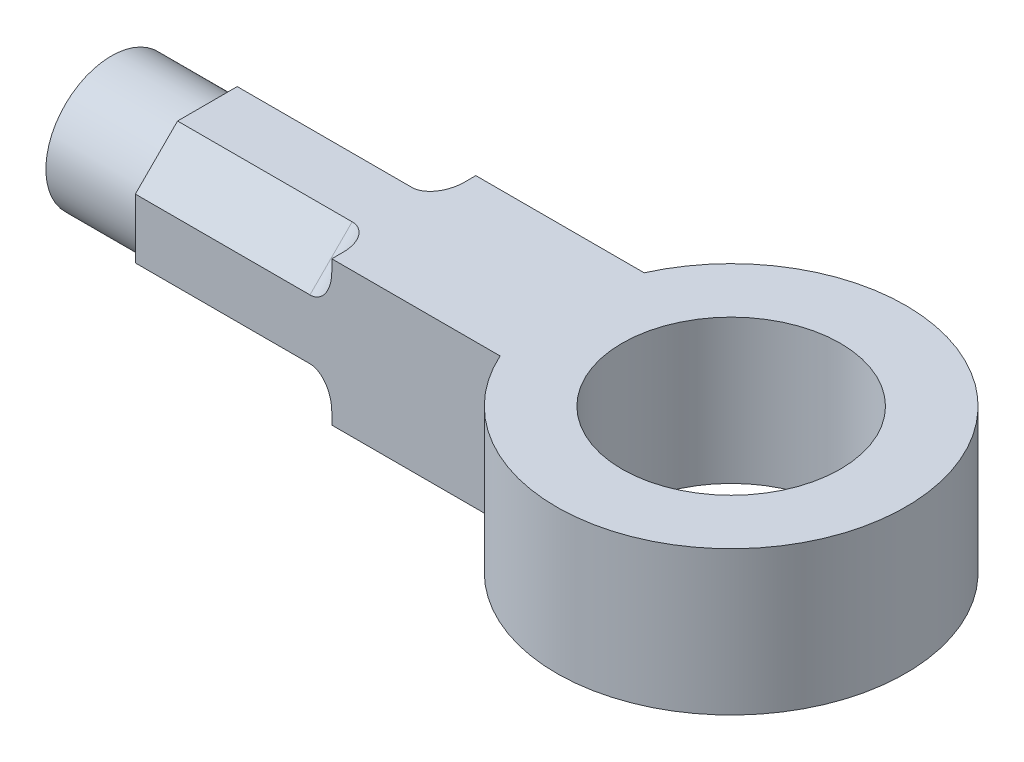
ISO-10303-21;
HEADER;
FILE_DESCRIPTION(('STEP AP214'),'2;1');
FILE_NAME('part.step','',(''),(''),'','','');
FILE_SCHEMA(('AUTOMOTIVE_DESIGN { 1 0 10303 214 1 1 1 1 }'));
ENDSEC;
DATA;
#1=APPLICATION_CONTEXT('core data for automotive mechanical design processes');
#2=APPLICATION_PROTOCOL_DEFINITION('international standard','automotive_design',2000,#1);
#3=PRODUCT_CONTEXT('',#1,'mechanical');
#4=PRODUCT('Part','Part','',(#3));
#5=PRODUCT_RELATED_PRODUCT_CATEGORY('part','',(#4));
#6=PRODUCT_DEFINITION_FORMATION('','',#4);
#7=PRODUCT_DEFINITION_CONTEXT('part definition',#1,'design');
#8=PRODUCT_DEFINITION('design','',#6,#7);
#9=PRODUCT_DEFINITION_SHAPE('','',#8);
#10=(LENGTH_UNIT() NAMED_UNIT(*) SI_UNIT(.MILLI.,.METRE.));
#11=(NAMED_UNIT(*) PLANE_ANGLE_UNIT() SI_UNIT($,.RADIAN.));
#12=(NAMED_UNIT(*) SI_UNIT($,.STERADIAN.) SOLID_ANGLE_UNIT());
#13=UNCERTAINTY_MEASURE_WITH_UNIT(LENGTH_MEASURE(1.E-05),#10,'distance_accuracy_value','');
#14=(GEOMETRIC_REPRESENTATION_CONTEXT(3) GLOBAL_UNCERTAINTY_ASSIGNED_CONTEXT((#13)) GLOBAL_UNIT_ASSIGNED_CONTEXT((#10,
#11,#12)) REPRESENTATION_CONTEXT('',''));
#15=CARTESIAN_POINT('',(0.,0.,0.));
#16=DIRECTION('',(0.,0.,1.));
#17=DIRECTION('',(1.,0.,0.));
#18=AXIS2_PLACEMENT_3D('',#15,#16,#17);
#19=CARTESIAN_POINT('',(-43.5576432117348,0.,0.));
#20=DIRECTION('',(-1.,0.,0.));
#21=DIRECTION('',(0.,0.,1.));
#22=AXIS2_PLACEMENT_3D('',#19,#20,#21);
#23=PLANE('',#22);
#24=DIRECTION('',(0.,0.,1.));
#25=VECTOR('',#24,1.);
#26=CARTESIAN_POINT('',(-43.5576432117348,1.65,-1.65));
#27=LINE('',#26,#25);
#28=CARTESIAN_POINT('',(-43.5576432117348,1.65,1.39055915910215));
#29=VERTEX_POINT('',#28);
#30=CARTESIAN_POINT('',(-43.5576432117348,1.65,1.65));
#31=VERTEX_POINT('',#30);
#32=EDGE_CURVE('E251',#29,#31,#27,.T.);
#33=ORIENTED_EDGE('',*,*,#32,.F.);
#34=DIRECTION('',(0.,-0.707106781186548,0.707106781186547));
#35=VECTOR('',#34,1.);
#36=CARTESIAN_POINT('',(-43.5576432117348,1.52027957955108,1.52027957955108));
#37=LINE('',#36,#35);
#38=CARTESIAN_POINT('',(-43.5576432117348,1.39055915910216,1.65));
#39=VERTEX_POINT('',#38);
#40=EDGE_CURVE('E201',#29,#39,#37,.T.);
#41=ORIENTED_EDGE('',*,*,#40,.T.);
#42=DIRECTION('',(0.,-1.,0.));
#43=VECTOR('',#42,1.);
#44=CARTESIAN_POINT('',(-43.5576432117348,1.65,1.65));
#45=LINE('',#44,#43);
#46=EDGE_CURVE('E191',#31,#39,#45,.T.);
#47=ORIENTED_EDGE('',*,*,#46,.F.);
#48=EDGE_LOOP('',(#33,#41,#47));
#49=FACE_BOUND('',#48,.T.);
#50=ADVANCED_FACE('F38',(#49),#23,.T.);
#51=CARTESIAN_POINT('',(-43.5576432117348,-1.39055915910215,1.65));
#52=VERTEX_POINT('',#51);
#53=CARTESIAN_POINT('',(-43.5576432117348,-1.65,1.65));
#54=VERTEX_POINT('',#53);
#55=EDGE_CURVE('E156',#52,#54,#45,.T.);
#56=ORIENTED_EDGE('',*,*,#55,.F.);
#57=DIRECTION('',(0.,-0.707106781186548,-0.707106781186548));
#58=VECTOR('',#57,1.);
#59=CARTESIAN_POINT('',(-43.5576432117348,-1.52027957955108,1.52027957955108));
#60=LINE('',#59,#58);
#61=CARTESIAN_POINT('',(-43.5576432117348,-1.65,1.39055915910215));
#62=VERTEX_POINT('',#61);
#63=EDGE_CURVE('E186',#52,#62,#60,.T.);
#64=ORIENTED_EDGE('',*,*,#63,.T.);
#65=DIRECTION('',(0.,0.,-1.));
#66=VECTOR('',#65,1.);
#67=CARTESIAN_POINT('',(-43.5576432117348,-1.65,-1.65));
#68=LINE('',#67,#66);
#69=EDGE_CURVE('E237',#54,#62,#68,.T.);
#70=ORIENTED_EDGE('',*,*,#69,.F.);
#71=EDGE_LOOP('',(#56,#64,#70));
#72=FACE_BOUND('',#71,.T.);
#73=ADVANCED_FACE('F355',(#72),#23,.T.);
#74=CARTESIAN_POINT('',(-43.5576432117348,-1.65,-1.39055915910215));
#75=VERTEX_POINT('',#74);
#76=CARTESIAN_POINT('',(-43.5576432117348,-1.65,-1.65));
#77=VERTEX_POINT('',#76);
#78=EDGE_CURVE('E239',#75,#77,#68,.T.);
#79=ORIENTED_EDGE('',*,*,#78,.F.);
#80=DIRECTION('',(0.,0.707106781186547,-0.707106781186548));
#81=VECTOR('',#80,1.);
#82=CARTESIAN_POINT('',(-43.5576432117348,-1.52027957955108,-1.52027957955108));
#83=LINE('',#82,#81);
#84=CARTESIAN_POINT('',(-43.5576432117348,-1.39055915910215,-1.65));
#85=VERTEX_POINT('',#84);
#86=EDGE_CURVE('E194',#75,#85,#83,.T.);
#87=ORIENTED_EDGE('',*,*,#86,.T.);
#88=DIRECTION('',(0.,1.,0.));
#89=VECTOR('',#88,1.);
#90=CARTESIAN_POINT('',(-43.5576432117348,1.65,-1.65));
#91=LINE('',#90,#89);
#92=EDGE_CURVE('E242',#77,#85,#91,.T.);
#93=ORIENTED_EDGE('',*,*,#92,.F.);
#94=EDGE_LOOP('',(#79,#87,#93));
#95=FACE_BOUND('',#94,.T.);
#96=ADVANCED_FACE('F362',(#95),#23,.T.);
#97=CARTESIAN_POINT('',(-43.5576432117348,1.39055915910216,-1.65));
#98=VERTEX_POINT('',#97);
#99=CARTESIAN_POINT('',(-43.5576432117348,1.65,-1.65));
#100=VERTEX_POINT('',#99);
#101=EDGE_CURVE('E245',#98,#100,#91,.T.);
#102=ORIENTED_EDGE('',*,*,#101,.F.);
#103=DIRECTION('',(0.,0.707106781186548,0.707106781186548));
#104=VECTOR('',#103,1.);
#105=CARTESIAN_POINT('',(-43.5576432117348,1.52027957955108,-1.52027957955108));
#106=LINE('',#105,#104);
#107=CARTESIAN_POINT('',(-43.5576432117348,1.65,-1.39055915910215));
#108=VERTEX_POINT('',#107);
#109=EDGE_CURVE('E208',#98,#108,#106,.T.);
#110=ORIENTED_EDGE('',*,*,#109,.T.);
#111=EDGE_CURVE('E249',#100,#108,#27,.T.);
#112=ORIENTED_EDGE('',*,*,#111,.F.);
#113=EDGE_LOOP('',(#102,#110,#112));
#114=FACE_BOUND('',#113,.T.);
#115=ADVANCED_FACE('F358',(#114),#23,.T.);
#116=CARTESIAN_POINT('',(-36.0576432117348,1.8,0.));
#117=DIRECTION('',(0.,-1.,0.));
#118=DIRECTION('',(0.,0.,-1.));
#119=AXIS2_PLACEMENT_3D('',#116,#117,#118);
#120=CYLINDRICAL_SURFACE('',#119,4.);
#121=DIRECTION('',(0.,-1.,0.));
#122=VECTOR('',#121,1.);
#123=CARTESIAN_POINT('',(-39.7014736139352,1.8,1.65));
#124=LINE('',#123,#122);
#125=CARTESIAN_POINT('',(-39.7014736139352,1.65,1.65));
#126=VERTEX_POINT('',#125);
#127=CARTESIAN_POINT('',(-39.7014736139383,-1.65,1.65));
#128=VERTEX_POINT('',#127);
#129=EDGE_CURVE('E154',#126,#128,#124,.T.);
#130=ORIENTED_EDGE('',*,*,#129,.T.);
#131=CARTESIAN_POINT('',(-36.0576432117348,-1.65,0.));
#132=DIRECTION('',(0.,1.,0.));
#133=DIRECTION('',(0.,0.,1.));
#134=AXIS2_PLACEMENT_3D('',#131,#132,#133);
#135=CIRCLE('',#134,4.);
#136=CARTESIAN_POINT('',(-39.7014736139352,-1.65,-1.65));
#137=VERTEX_POINT('',#136);
#138=EDGE_CURVE('E164',#128,#137,#135,.T.);
#139=ORIENTED_EDGE('',*,*,#138,.T.);
#140=DIRECTION('',(0.,-1.,0.));
#141=VECTOR('',#140,1.);
#142=CARTESIAN_POINT('',(-39.7014736139352,1.8,-1.65));
#143=LINE('',#142,#141);
#144=CARTESIAN_POINT('',(-39.7014736139383,1.65,-1.65));
#145=VERTEX_POINT('',#144);
#146=EDGE_CURVE('E179',#137,#145,#143,.F.);
#147=ORIENTED_EDGE('',*,*,#146,.T.);
#148=CARTESIAN_POINT('',(-36.0576432117348,1.65,0.));
#149=DIRECTION('',(0.,-1.,0.));
#150=DIRECTION('',(0.,0.,-1.));
#151=AXIS2_PLACEMENT_3D('',#148,#149,#150);
#152=CIRCLE('',#151,4.);
#153=EDGE_CURVE('E177',#145,#126,#152,.T.);
#154=ORIENTED_EDGE('',*,*,#153,.T.);
#155=EDGE_LOOP('',(#130,#139,#147,#154));
#156=FACE_BOUND('',#155,.T.);
#157=ADVANCED_FACE('F175',(#156),#120,.T.);
#158=CARTESIAN_POINT('',(-36.0576432117348,1.8,0.));
#159=DIRECTION('',(0.,-1.,0.));
#160=DIRECTION('',(0.,0.,-1.));
#161=AXIS2_PLACEMENT_3D('',#158,#159,#160);
#162=CYLINDRICAL_SURFACE('',#161,2.5);
#163=CARTESIAN_POINT('',(-36.0576432117348,-1.65,0.));
#164=DIRECTION('',(0.,1.,0.));
#165=DIRECTION('',(0.,0.,1.));
#166=AXIS2_PLACEMENT_3D('',#163,#164,#165);
#167=CIRCLE('',#166,2.5);
#168=CARTESIAN_POINT('',(-36.0576432117348,-1.65,2.5));
#169=VERTEX_POINT('',#168);
#170=EDGE_CURVE('E172',#169,#169,#167,.T.);
#171=ORIENTED_EDGE('',*,*,#170,.F.);
#172=EDGE_LOOP('',(#171));
#173=FACE_BOUND('',#172,.T.);
#174=CARTESIAN_POINT('',(-36.0576432117348,1.65,0.));
#175=DIRECTION('',(0.,-1.,0.));
#176=DIRECTION('',(0.,0.,-1.));
#177=AXIS2_PLACEMENT_3D('',#174,#175,#176);
#178=CIRCLE('',#177,2.5);
#179=CARTESIAN_POINT('',(-36.0576432117348,1.65,-2.5));
#180=VERTEX_POINT('',#179);
#181=EDGE_CURVE('E322',#180,#180,#178,.T.);
#182=ORIENTED_EDGE('',*,*,#181,.F.);
#183=EDGE_LOOP('',(#182));
#184=FACE_BOUND('',#183,.T.);
#185=ADVANCED_FACE('F335',(#173,#184),#162,.F.);
#186=CARTESIAN_POINT('',(49963.9423567883,1.65,1.65));
#187=DIRECTION('',(0.,0.,-1.));
#188=DIRECTION('',(0.,1.,0.));
#189=AXIS2_PLACEMENT_3D('',#186,#187,#188);
#190=PLANE('',#189);
#191=DIRECTION('',(-1.,0.,0.));
#192=VECTOR('',#191,1.);
#193=CARTESIAN_POINT('',(49963.9423567883,-1.65,1.65));
#194=LINE('',#193,#192);
#195=EDGE_CURVE('E150',#128,#54,#194,.T.);
#196=ORIENTED_EDGE('',*,*,#195,.F.);
#197=ORIENTED_EDGE('',*,*,#129,.F.);
#198=DIRECTION('',(-1.,0.,0.));
#199=VECTOR('',#198,1.);
#200=CARTESIAN_POINT('',(49963.9423567883,1.65,1.65));
#201=LINE('',#200,#199);
#202=EDGE_CURVE('E255',#126,#31,#201,.T.);
#203=ORIENTED_EDGE('',*,*,#202,.T.);
#204=ORIENTED_EDGE('',*,*,#46,.T.);
#205=CARTESIAN_POINT('',(-44.0576432117348,1.39055915910216,1.65));
#206=DIRECTION('',(0.,0.,-1.));
#207=DIRECTION('',(0.,-1.,0.));
#208=AXIS2_PLACEMENT_3D('',#205,#206,#207);
#209=ELLIPSE('',#208,0.707106781186547,0.5);
#210=CARTESIAN_POINT('',(-44.0576432117348,0.683452377915609,1.65));
#211=VERTEX_POINT('',#210);
#212=EDGE_CURVE('E226',#39,#211,#209,.T.);
#213=ORIENTED_EDGE('',*,*,#212,.T.);
#214=DIRECTION('',(-1.,0.,0.));
#215=VECTOR('',#214,1.);
#216=CARTESIAN_POINT('',(-43.5576432117348,0.683452377915609,1.65));
#217=LINE('',#216,#215);
#218=CARTESIAN_POINT('',(-48.0576432117348,0.683452377915609,1.65));
#219=VERTEX_POINT('',#218);
#220=EDGE_CURVE('E182',#211,#219,#217,.T.);
#221=ORIENTED_EDGE('',*,*,#220,.T.);
#222=DIRECTION('',(0.,-1.,0.));
#223=VECTOR('',#222,1.);
#224=CARTESIAN_POINT('',(-48.0576432117348,0.683452377915609,1.65));
#225=LINE('',#224,#223);
#226=CARTESIAN_POINT('',(-48.0576432117348,-0.683452377915605,1.65));
#227=VERTEX_POINT('',#226);
#228=EDGE_CURVE('E309',#219,#227,#225,.T.);
#229=ORIENTED_EDGE('',*,*,#228,.T.);
#230=DIRECTION('',(-1.,0.,0.));
#231=VECTOR('',#230,1.);
#232=CARTESIAN_POINT('',(-43.5576432117348,-0.683452377915605,1.65));
#233=LINE('',#232,#231);
#234=CARTESIAN_POINT('',(-44.0576432117348,-0.683452377915605,1.65));
#235=VERTEX_POINT('',#234);
#236=EDGE_CURVE('E265',#235,#227,#233,.T.);
#237=ORIENTED_EDGE('',*,*,#236,.F.);
#238=CARTESIAN_POINT('',(-44.0576432117348,-1.39055915910215,1.65));
#239=DIRECTION('',(0.,0.,-1.));
#240=DIRECTION('',(0.,-1.,0.));
#241=AXIS2_PLACEMENT_3D('',#238,#239,#240);
#242=ELLIPSE('',#241,0.707106781186548,0.5);
#243=EDGE_CURVE('E217',#235,#52,#242,.T.);
#244=ORIENTED_EDGE('',*,*,#243,.T.);
#245=ORIENTED_EDGE('',*,*,#55,.T.);
#246=EDGE_LOOP('',(#196,#197,#203,#204,#213,#221,#229,#237,#244,#245));
#247=FACE_BOUND('',#246,.T.);
#248=ADVANCED_FACE('F152',(#247),#190,.F.);
#249=CARTESIAN_POINT('',(49963.9423567883,-1.65,-1.65));
#250=DIRECTION('',(0.,1.,0.));
#251=DIRECTION('',(0.,0.,1.));
#252=AXIS2_PLACEMENT_3D('',#249,#250,#251);
#253=PLANE('',#252);
#254=DIRECTION('',(0.,0.,-1.));
#255=VECTOR('',#254,1.);
#256=CARTESIAN_POINT('',(-48.0576432117348,-1.65,0.683452377915607));
#257=LINE('',#256,#255);
#258=CARTESIAN_POINT('',(-48.0576432117348,-1.65,0.683452377915607));
#259=VERTEX_POINT('',#258);
#260=CARTESIAN_POINT('',(-48.0576432117348,-1.65,-0.683452377915607));
#261=VERTEX_POINT('',#260);
#262=EDGE_CURVE('E302',#259,#261,#257,.T.);
#263=ORIENTED_EDGE('',*,*,#262,.T.);
#264=DIRECTION('',(-1.,0.,0.));
#265=VECTOR('',#264,1.);
#266=CARTESIAN_POINT('',(-43.5576432117348,-1.65,-0.683452377915607));
#267=LINE('',#266,#265);
#268=CARTESIAN_POINT('',(-44.0576432117348,-1.65,-0.683452377915607));
#269=VERTEX_POINT('',#268);
#270=EDGE_CURVE('E271',#269,#261,#267,.T.);
#271=ORIENTED_EDGE('',*,*,#270,.F.);
#272=CARTESIAN_POINT('',(-44.0576432117348,-1.65,-1.39055915910215));
#273=DIRECTION('',(0.,1.,0.));
#274=DIRECTION('',(0.,0.,-1.));
#275=AXIS2_PLACEMENT_3D('',#272,#273,#274);
#276=ELLIPSE('',#275,0.707106781186548,0.5);
#277=EDGE_CURVE('E223',#269,#75,#276,.T.);
#278=ORIENTED_EDGE('',*,*,#277,.T.);
#279=ORIENTED_EDGE('',*,*,#78,.T.);
#280=DIRECTION('',(-1.,0.,0.));
#281=VECTOR('',#280,1.);
#282=CARTESIAN_POINT('',(49963.9423567883,-1.65,-1.65));
#283=LINE('',#282,#281);
#284=EDGE_CURVE('E161',#137,#77,#283,.T.);
#285=ORIENTED_EDGE('',*,*,#284,.F.);
#286=ORIENTED_EDGE('',*,*,#138,.F.);
#287=ORIENTED_EDGE('',*,*,#195,.T.);
#288=ORIENTED_EDGE('',*,*,#69,.T.);
#289=CARTESIAN_POINT('',(-44.0576432117348,-1.65,1.39055915910215));
#290=DIRECTION('',(0.,1.,0.));
#291=DIRECTION('',(0.,0.,-1.));
#292=AXIS2_PLACEMENT_3D('',#289,#290,#291);
#293=ELLIPSE('',#292,0.707106781186547,0.5);
#294=CARTESIAN_POINT('',(-44.0576432117348,-1.65,0.683452377915607));
#295=VERTEX_POINT('',#294);
#296=EDGE_CURVE('E214',#62,#295,#293,.T.);
#297=ORIENTED_EDGE('',*,*,#296,.T.);
#298=DIRECTION('',(-1.,0.,0.));
#299=VECTOR('',#298,1.);
#300=CARTESIAN_POINT('',(-43.5576432117348,-1.65,0.683452377915607));
#301=LINE('',#300,#299);
#302=EDGE_CURVE('E268',#295,#259,#301,.T.);
#303=ORIENTED_EDGE('',*,*,#302,.T.);
#304=EDGE_LOOP('',(#263,#271,#278,#279,#285,#286,#287,#288,#297,#303));
#305=FACE_BOUND('',#304,.T.);
#306=ORIENTED_EDGE('',*,*,#170,.T.);
#307=EDGE_LOOP('',(#306));
#308=FACE_BOUND('',#307,.T.);
#309=ADVANCED_FACE('F166',(#305,#308),#253,.F.);
#310=CARTESIAN_POINT('',(49963.9423567883,1.65,-1.65));
#311=DIRECTION('',(0.,0.,1.));
#312=DIRECTION('',(0.,-1.,0.));
#313=AXIS2_PLACEMENT_3D('',#310,#311,#312);
#314=PLANE('',#313);
#315=ORIENTED_EDGE('',*,*,#146,.F.);
#316=ORIENTED_EDGE('',*,*,#284,.T.);
#317=ORIENTED_EDGE('',*,*,#92,.T.);
#318=CARTESIAN_POINT('',(-44.0576432117348,-1.39055915910215,-1.65));
#319=DIRECTION('',(0.,0.,1.));
#320=DIRECTION('',(0.,1.,0.));
#321=AXIS2_PLACEMENT_3D('',#318,#319,#320);
#322=ELLIPSE('',#321,0.707106781186547,0.5);
#323=CARTESIAN_POINT('',(-44.0576432117348,-0.683452377915606,-1.65));
#324=VERTEX_POINT('',#323);
#325=EDGE_CURVE('E220',#85,#324,#322,.T.);
#326=ORIENTED_EDGE('',*,*,#325,.T.);
#327=DIRECTION('',(-1.,0.,0.));
#328=VECTOR('',#327,1.);
#329=CARTESIAN_POINT('',(-43.5576432117348,-0.683452377915606,-1.65));
#330=LINE('',#329,#328);
#331=CARTESIAN_POINT('',(-48.0576432117348,-0.683452377915606,-1.65));
#332=VERTEX_POINT('',#331);
#333=EDGE_CURVE('E274',#324,#332,#330,.T.);
#334=ORIENTED_EDGE('',*,*,#333,.T.);
#335=DIRECTION('',(0.,1.,0.));
#336=VECTOR('',#335,1.);
#337=CARTESIAN_POINT('',(-48.0576432117348,-0.683452377915606,-1.65));
#338=LINE('',#337,#336);
#339=CARTESIAN_POINT('',(-48.0576432117348,0.683452377915608,-1.65));
#340=VERTEX_POINT('',#339);
#341=EDGE_CURVE('E294',#332,#340,#338,.T.);
#342=ORIENTED_EDGE('',*,*,#341,.T.);
#343=DIRECTION('',(-1.,0.,0.));
#344=VECTOR('',#343,1.);
#345=CARTESIAN_POINT('',(-43.5576432117348,0.683452377915608,-1.65));
#346=LINE('',#345,#344);
#347=CARTESIAN_POINT('',(-44.0576432117348,0.683452377915608,-1.65));
#348=VERTEX_POINT('',#347);
#349=EDGE_CURVE('E277',#348,#340,#346,.T.);
#350=ORIENTED_EDGE('',*,*,#349,.F.);
#351=CARTESIAN_POINT('',(-44.0576432117348,1.39055915910216,-1.65));
#352=DIRECTION('',(0.,0.,1.));
#353=DIRECTION('',(0.,1.,0.));
#354=AXIS2_PLACEMENT_3D('',#351,#352,#353);
#355=ELLIPSE('',#354,0.707106781186548,0.5);
#356=EDGE_CURVE('E11',#348,#98,#355,.T.);
#357=ORIENTED_EDGE('',*,*,#356,.T.);
#358=ORIENTED_EDGE('',*,*,#101,.T.);
#359=DIRECTION('',(-1.,0.,0.));
#360=VECTOR('',#359,1.);
#361=CARTESIAN_POINT('',(49963.9423567883,1.65,-1.65));
#362=LINE('',#361,#360);
#363=EDGE_CURVE('E257',#145,#100,#362,.T.);
#364=ORIENTED_EDGE('',*,*,#363,.F.);
#365=EDGE_LOOP('',(#315,#316,#317,#326,#334,#342,#350,#357,#358,#364));
#366=FACE_BOUND('',#365,.T.);
#367=ADVANCED_FACE('F344',(#366),#314,.F.);
#368=CARTESIAN_POINT('',(49963.9423567883,1.65,-1.65));
#369=DIRECTION('',(0.,-1.,0.));
#370=DIRECTION('',(0.,0.,-1.));
#371=AXIS2_PLACEMENT_3D('',#368,#369,#370);
#372=PLANE('',#371);
#373=ORIENTED_EDGE('',*,*,#32,.T.);
#374=ORIENTED_EDGE('',*,*,#202,.F.);
#375=ORIENTED_EDGE('',*,*,#153,.F.);
#376=ORIENTED_EDGE('',*,*,#363,.T.);
#377=ORIENTED_EDGE('',*,*,#111,.T.);
#378=CARTESIAN_POINT('',(-44.0576432117348,1.65,-1.39055915910215));
#379=DIRECTION('',(0.,-1.,0.));
#380=DIRECTION('',(0.,0.,1.));
#381=AXIS2_PLACEMENT_3D('',#378,#379,#380);
#382=ELLIPSE('',#381,0.707106781186547,0.5);
#383=CARTESIAN_POINT('',(-44.0576432117348,1.65,-0.683452377915607));
#384=VERTEX_POINT('',#383);
#385=EDGE_CURVE('E47',#108,#384,#382,.T.);
#386=ORIENTED_EDGE('',*,*,#385,.T.);
#387=DIRECTION('',(-1.,0.,0.));
#388=VECTOR('',#387,1.);
#389=CARTESIAN_POINT('',(-43.5576432117348,1.65,-0.683452377915607));
#390=LINE('',#389,#388);
#391=CARTESIAN_POINT('',(-48.0576432117348,1.65,-0.683452377915607));
#392=VERTEX_POINT('',#391);
#393=EDGE_CURVE('E280',#384,#392,#390,.T.);
#394=ORIENTED_EDGE('',*,*,#393,.T.);
#395=DIRECTION('',(0.,0.,1.));
#396=VECTOR('',#395,1.);
#397=CARTESIAN_POINT('',(-48.0576432117348,1.65,-0.683452377915607));
#398=LINE('',#397,#396);
#399=CARTESIAN_POINT('',(-48.0576432117348,1.65,0.683452377915607));
#400=VERTEX_POINT('',#399);
#401=EDGE_CURVE('E286',#392,#400,#398,.T.);
#402=ORIENTED_EDGE('',*,*,#401,.T.);
#403=DIRECTION('',(-1.,0.,0.));
#404=VECTOR('',#403,1.);
#405=CARTESIAN_POINT('',(-43.5576432117348,1.65,0.683452377915607));
#406=LINE('',#405,#404);
#407=CARTESIAN_POINT('',(-44.0576432117348,1.65,0.683452377915607));
#408=VERTEX_POINT('',#407);
#409=EDGE_CURVE('E283',#408,#400,#406,.T.);
#410=ORIENTED_EDGE('',*,*,#409,.F.);
#411=CARTESIAN_POINT('',(-44.0576432117348,1.65,1.39055915910215));
#412=DIRECTION('',(0.,-1.,0.));
#413=DIRECTION('',(0.,0.,1.));
#414=AXIS2_PLACEMENT_3D('',#411,#412,#413);
#415=ELLIPSE('',#414,0.707106781186547,0.5);
#416=EDGE_CURVE('E229',#408,#29,#415,.T.);
#417=ORIENTED_EDGE('',*,*,#416,.T.);
#418=EDGE_LOOP('',(#373,#374,#375,#376,#377,#386,#394,#402,#410,#417));
#419=FACE_BOUND('',#418,.T.);
#420=ORIENTED_EDGE('',*,*,#181,.T.);
#421=EDGE_LOOP('',(#420));
#422=FACE_BOUND('',#421,.T.);
#423=ADVANCED_FACE('F339',(#419,#422),#372,.F.);
#424=CARTESIAN_POINT('',(-43.5576432117348,1.65,0.683452377915607));
#425=DIRECTION('',(0.,-0.707106781186547,-0.707106781186548));
#426=DIRECTION('',(0.,0.707106781186548,-0.707106781186547));
#427=AXIS2_PLACEMENT_3D('',#424,#425,#426);
#428=PLANE('',#427);
#429=ORIENTED_EDGE('',*,*,#220,.F.);
#430=DIRECTION('',(0.,-0.707106781186548,0.707106781186547));
#431=VECTOR('',#430,1.);
#432=CARTESIAN_POINT('',(-44.0576432117348,1.65,0.683452377915607));
#433=LINE('',#432,#431);
#434=EDGE_CURVE('E205',#211,#408,#433,.F.);
#435=ORIENTED_EDGE('',*,*,#434,.T.);
#436=ORIENTED_EDGE('',*,*,#409,.T.);
#437=DIRECTION('',(0.,-0.707106781186547,0.707106781186547));
#438=VECTOR('',#437,1.);
#439=CARTESIAN_POINT('',(-48.0576432117348,1.65,0.683452377915607));
#440=LINE('',#439,#438);
#441=EDGE_CURVE('E313',#400,#219,#440,.T.);
#442=ORIENTED_EDGE('',*,*,#441,.T.);
#443=EDGE_LOOP('',(#429,#435,#436,#442));
#444=FACE_BOUND('',#443,.T.);
#445=ADVANCED_FACE('F343',(#444),#428,.F.);
#446=CARTESIAN_POINT('',(-43.5576432117348,-0.683452377915605,1.65));
#447=DIRECTION('',(0.,0.707106781186547,-0.707106781186547));
#448=DIRECTION('',(0.,0.707106781186548,0.707106781186548));
#449=AXIS2_PLACEMENT_3D('',#446,#447,#448);
#450=PLANE('',#449);
#451=ORIENTED_EDGE('',*,*,#302,.F.);
#452=DIRECTION('',(0.,-0.707106781186548,-0.707106781186548));
#453=VECTOR('',#452,1.);
#454=CARTESIAN_POINT('',(-44.0576432117348,-0.683452377915605,1.65));
#455=LINE('',#454,#453);
#456=EDGE_CURVE('E190',#295,#235,#455,.F.);
#457=ORIENTED_EDGE('',*,*,#456,.T.);
#458=ORIENTED_EDGE('',*,*,#236,.T.);
#459=DIRECTION('',(0.,-0.707106781186547,-0.707106781186547));
#460=VECTOR('',#459,1.);
#461=CARTESIAN_POINT('',(-48.0576432117348,-0.683452377915605,1.65));
#462=LINE('',#461,#460);
#463=EDGE_CURVE('E305',#227,#259,#462,.T.);
#464=ORIENTED_EDGE('',*,*,#463,.T.);
#465=EDGE_LOOP('',(#451,#457,#458,#464));
#466=FACE_BOUND('',#465,.T.);
#467=ADVANCED_FACE('F350',(#466),#450,.F.);
#468=CARTESIAN_POINT('',(-43.5576432117348,-1.65,-0.683452377915607));
#469=DIRECTION('',(0.,0.707106781186548,0.707106781186547));
#470=DIRECTION('',(0.,-0.707106781186547,0.707106781186548));
#471=AXIS2_PLACEMENT_3D('',#468,#469,#470);
#472=PLANE('',#471);
#473=ORIENTED_EDGE('',*,*,#333,.F.);
#474=DIRECTION('',(0.,0.707106781186547,-0.707106781186548));
#475=VECTOR('',#474,1.);
#476=CARTESIAN_POINT('',(-44.0576432117348,-1.65,-0.683452377915607));
#477=LINE('',#476,#475);
#478=EDGE_CURVE('E198',#324,#269,#477,.F.);
#479=ORIENTED_EDGE('',*,*,#478,.T.);
#480=ORIENTED_EDGE('',*,*,#270,.T.);
#481=DIRECTION('',(0.,0.707106781186547,-0.707106781186548));
#482=VECTOR('',#481,1.);
#483=CARTESIAN_POINT('',(-48.0576432117348,-1.65,-0.683452377915607));
#484=LINE('',#483,#482);
#485=EDGE_CURVE('E298',#261,#332,#484,.T.);
#486=ORIENTED_EDGE('',*,*,#485,.T.);
#487=EDGE_LOOP('',(#473,#479,#480,#486));
#488=FACE_BOUND('',#487,.T.);
#489=ADVANCED_FACE('F411',(#488),#472,.F.);
#490=CARTESIAN_POINT('',(-43.5576432117348,0.683452377915608,-1.65));
#491=DIRECTION('',(0.,-0.707106781186547,0.707106781186547));
#492=DIRECTION('',(0.,-0.707106781186548,-0.707106781186548));
#493=AXIS2_PLACEMENT_3D('',#490,#491,#492);
#494=PLANE('',#493);
#495=ORIENTED_EDGE('',*,*,#393,.F.);
#496=DIRECTION('',(0.,0.707106781186548,0.707106781186548));
#497=VECTOR('',#496,1.);
#498=CARTESIAN_POINT('',(-44.0576432117348,0.683452377915608,-1.65));
#499=LINE('',#498,#497);
#500=EDGE_CURVE('E54',#384,#348,#499,.F.);
#501=ORIENTED_EDGE('',*,*,#500,.T.);
#502=ORIENTED_EDGE('',*,*,#349,.T.);
#503=DIRECTION('',(0.,0.707106781186547,0.707106781186548));
#504=VECTOR('',#503,1.);
#505=CARTESIAN_POINT('',(-48.0576432117348,0.683452377915608,-1.65));
#506=LINE('',#505,#504);
#507=EDGE_CURVE('E290',#340,#392,#506,.T.);
#508=ORIENTED_EDGE('',*,*,#507,.T.);
#509=EDGE_LOOP('',(#495,#501,#502,#508));
#510=FACE_BOUND('',#509,.T.);
#511=ADVANCED_FACE('F382',(#510),#494,.F.);
#512=CARTESIAN_POINT('',(-48.0576432117348,0.,0.));
#513=DIRECTION('',(1.,0.,0.));
#514=DIRECTION('',(0.,0.,-1.));
#515=AXIS2_PLACEMENT_3D('',#512,#513,#514);
#516=PLANE('',#515);
#517=CARTESIAN_POINT('',(-48.0576432117348,0.,0.));
#518=DIRECTION('',(1.,0.,0.));
#519=DIRECTION('',(0.,0.,-1.));
#520=AXIS2_PLACEMENT_3D('',#517,#518,#519);
#521=CIRCLE('',#520,1.5);
#522=CARTESIAN_POINT('',(-48.0576432117348,0.,-1.5));
#523=VERTEX_POINT('',#522);
#524=EDGE_CURVE('E318',#523,#523,#521,.T.);
#525=ORIENTED_EDGE('',*,*,#524,.T.);
#526=EDGE_LOOP('',(#525));
#527=FACE_BOUND('',#526,.T.);
#528=ORIENTED_EDGE('',*,*,#441,.F.);
#529=ORIENTED_EDGE('',*,*,#401,.F.);
#530=ORIENTED_EDGE('',*,*,#507,.F.);
#531=ORIENTED_EDGE('',*,*,#341,.F.);
#532=ORIENTED_EDGE('',*,*,#485,.F.);
#533=ORIENTED_EDGE('',*,*,#262,.F.);
#534=ORIENTED_EDGE('',*,*,#463,.F.);
#535=ORIENTED_EDGE('',*,*,#228,.F.);
#536=EDGE_LOOP('',(#528,#529,#530,#531,#532,#533,#534,#535));
#537=FACE_BOUND('',#536,.T.);
#538=ADVANCED_FACE('F386',(#527,#537),#516,.F.);
#539=CARTESIAN_POINT('',(-50.2576432117348,0.,0.));
#540=DIRECTION('',(1.,0.,0.));
#541=DIRECTION('',(0.,0.,-1.));
#542=AXIS2_PLACEMENT_3D('',#539,#540,#541);
#543=CYLINDRICAL_SURFACE('',#542,1.5);
#544=CARTESIAN_POINT('',(-50.2576432117348,0.,0.));
#545=DIRECTION('',(1.,0.,0.));
#546=DIRECTION('',(0.,0.,-1.));
#547=AXIS2_PLACEMENT_3D('',#544,#545,#546);
#548=CIRCLE('',#547,1.5);
#549=CARTESIAN_POINT('',(-50.2576432117348,0.,-1.5));
#550=VERTEX_POINT('',#549);
#551=EDGE_CURVE('E317',#550,#550,#548,.T.);
#552=ORIENTED_EDGE('',*,*,#551,.T.);
#553=EDGE_LOOP('',(#552));
#554=FACE_BOUND('',#553,.T.);
#555=ORIENTED_EDGE('',*,*,#524,.F.);
#556=EDGE_LOOP('',(#555));
#557=FACE_BOUND('',#556,.T.);
#558=ADVANCED_FACE('F429',(#554,#557),#543,.T.);
#559=CARTESIAN_POINT('',(-50.2576432117348,0.,0.));
#560=DIRECTION('',(1.,0.,0.));
#561=DIRECTION('',(0.,0.,-1.));
#562=AXIS2_PLACEMENT_3D('',#559,#560,#561);
#563=PLANE('',#562);
#564=ORIENTED_EDGE('',*,*,#551,.F.);
#565=EDGE_LOOP('',(#564));
#566=FACE_BOUND('',#565,.T.);
#567=ADVANCED_FACE('F424',(#566),#563,.F.);
#568=CARTESIAN_POINT('',(-44.0576432117348,-1.52027957955108,1.52027957955108));
#569=DIRECTION('',(0.,-0.707106781186548,-0.707106781186548));
#570=DIRECTION('',(0.,0.707106781186548,-0.707106781186548));
#571=AXIS2_PLACEMENT_3D('',#568,#569,#570);
#572=CYLINDRICAL_SURFACE('',#571,0.5);
#573=ORIENTED_EDGE('',*,*,#243,.F.);
#574=ORIENTED_EDGE('',*,*,#456,.F.);
#575=ORIENTED_EDGE('',*,*,#296,.F.);
#576=ORIENTED_EDGE('',*,*,#63,.F.);
#577=EDGE_LOOP('',(#573,#574,#575,#576));
#578=FACE_BOUND('',#577,.T.);
#579=ADVANCED_FACE('F406',(#578),#572,.F.);
#580=CARTESIAN_POINT('',(-44.0576432117348,-1.52027957955108,-1.52027957955108));
#581=DIRECTION('',(0.,0.707106781186547,-0.707106781186548));
#582=DIRECTION('',(0.,0.707106781186548,0.707106781186547));
#583=AXIS2_PLACEMENT_3D('',#580,#581,#582);
#584=CYLINDRICAL_SURFACE('',#583,0.5);
#585=ORIENTED_EDGE('',*,*,#277,.F.);
#586=ORIENTED_EDGE('',*,*,#478,.F.);
#587=ORIENTED_EDGE('',*,*,#325,.F.);
#588=ORIENTED_EDGE('',*,*,#86,.F.);
#589=EDGE_LOOP('',(#585,#586,#587,#588));
#590=FACE_BOUND('',#589,.T.);
#591=ADVANCED_FACE('F414',(#590),#584,.F.);
#592=CARTESIAN_POINT('',(-44.0576432117348,1.52027957955108,1.52027957955108));
#593=DIRECTION('',(0.,-0.707106781186548,0.707106781186547));
#594=DIRECTION('',(0.,-0.707106781186547,-0.707106781186548));
#595=AXIS2_PLACEMENT_3D('',#592,#593,#594);
#596=CYLINDRICAL_SURFACE('',#595,0.5);
#597=ORIENTED_EDGE('',*,*,#416,.F.);
#598=ORIENTED_EDGE('',*,*,#434,.F.);
#599=ORIENTED_EDGE('',*,*,#212,.F.);
#600=ORIENTED_EDGE('',*,*,#40,.F.);
#601=EDGE_LOOP('',(#597,#598,#599,#600));
#602=FACE_BOUND('',#601,.T.);
#603=ADVANCED_FACE('F393',(#602),#596,.F.);
#604=CARTESIAN_POINT('',(-44.0576432117348,1.52027957955108,-1.52027957955108));
#605=DIRECTION('',(0.,0.707106781186548,0.707106781186548));
#606=DIRECTION('',(0.,-0.707106781186548,0.707106781186548));
#607=AXIS2_PLACEMENT_3D('',#604,#605,#606);
#608=CYLINDRICAL_SURFACE('',#607,0.5);
#609=ORIENTED_EDGE('',*,*,#356,.F.);
#610=ORIENTED_EDGE('',*,*,#500,.F.);
#611=ORIENTED_EDGE('',*,*,#385,.F.);
#612=ORIENTED_EDGE('',*,*,#109,.F.);
#613=EDGE_LOOP('',(#609,#610,#611,#612));
#614=FACE_BOUND('',#613,.T.);
#615=ADVANCED_FACE('F40',(#614),#608,.F.);
#616=CLOSED_SHELL('',(#50,#73,#96,#115,#157,#185,#248,#309,#367,#423,#445,#467,#489,#511,#538,
#558,#567,#579,#591,#603,#615));
#617=MANIFOLD_SOLID_BREP('B2',#616);
#618=ADVANCED_BREP_SHAPE_REPRESENTATION('',(#18,#617),#14);
#619=SHAPE_DEFINITION_REPRESENTATION(#9,#618);
ENDSEC;
END-ISO-10303-21;
